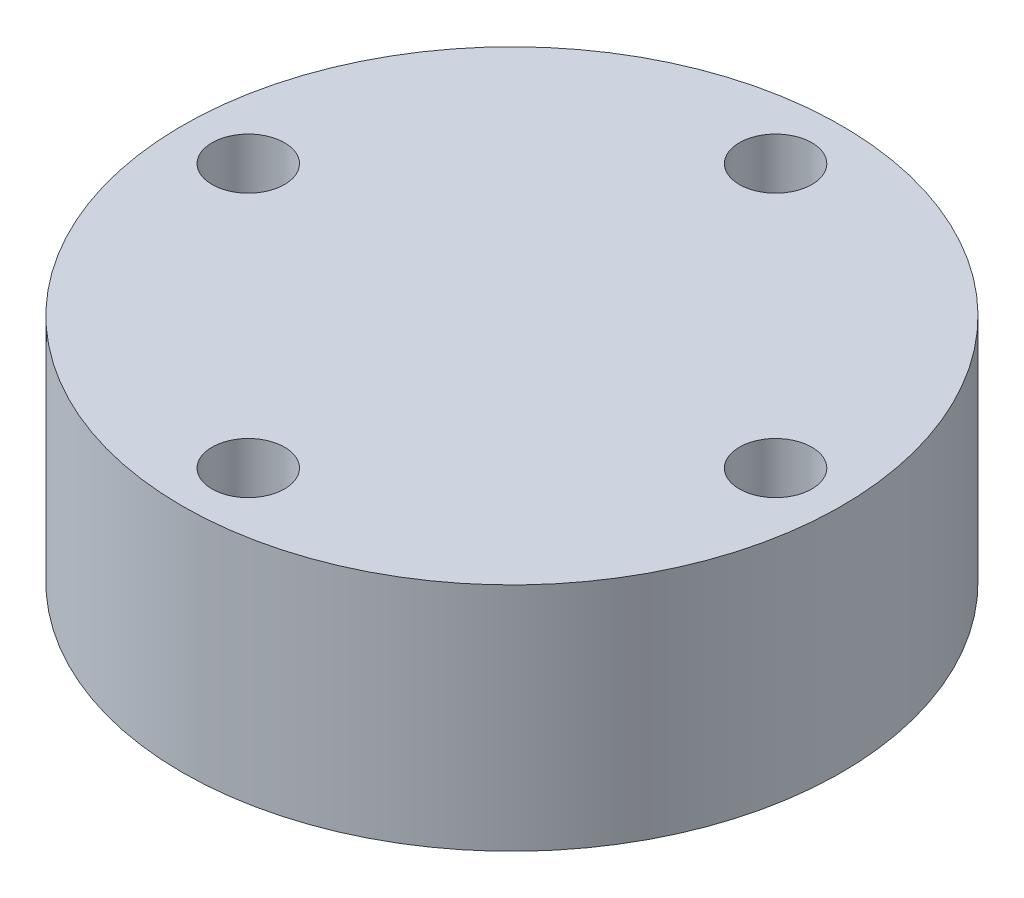
ISO-10303-21;
HEADER;
FILE_DESCRIPTION(('STEP AP214'),'2;1');
FILE_NAME('part.step','',(''),(''),'','','');
FILE_SCHEMA(('AUTOMOTIVE_DESIGN { 1 0 10303 214 1 1 1 1 }'));
ENDSEC;
DATA;
#1=APPLICATION_CONTEXT('core data for automotive mechanical design processes');
#2=APPLICATION_PROTOCOL_DEFINITION('international standard','automotive_design',2000,#1);
#3=PRODUCT_CONTEXT('',#1,'mechanical');
#4=PRODUCT('Part','Part','',(#3));
#5=PRODUCT_RELATED_PRODUCT_CATEGORY('part','',(#4));
#6=PRODUCT_DEFINITION_FORMATION('','',#4);
#7=PRODUCT_DEFINITION_CONTEXT('part definition',#1,'design');
#8=PRODUCT_DEFINITION('design','',#6,#7);
#9=PRODUCT_DEFINITION_SHAPE('','',#8);
#10=(LENGTH_UNIT() NAMED_UNIT(*) SI_UNIT(.MILLI.,.METRE.));
#11=(NAMED_UNIT(*) PLANE_ANGLE_UNIT() SI_UNIT($,.RADIAN.));
#12=(NAMED_UNIT(*) SI_UNIT($,.STERADIAN.) SOLID_ANGLE_UNIT());
#13=UNCERTAINTY_MEASURE_WITH_UNIT(LENGTH_MEASURE(1.E-05),#10,'distance_accuracy_value','');
#14=(GEOMETRIC_REPRESENTATION_CONTEXT(3) GLOBAL_UNCERTAINTY_ASSIGNED_CONTEXT((#13)) GLOBAL_UNIT_ASSIGNED_CONTEXT((#10,
#11,#12)) REPRESENTATION_CONTEXT('',''));
#15=CARTESIAN_POINT('',(0.,0.,0.));
#16=DIRECTION('',(0.,0.,1.));
#17=DIRECTION('',(1.,0.,0.));
#18=AXIS2_PLACEMENT_3D('',#15,#16,#17);
#19=CARTESIAN_POINT('',(0.,7.,0.));
#20=DIRECTION('',(0.,1.,0.));
#21=DIRECTION('',(0.,0.,1.));
#22=AXIS2_PLACEMENT_3D('',#19,#20,#21);
#23=PLANE('',#22);
#24=CARTESIAN_POINT('',(0.,7.,8.));
#25=DIRECTION('',(0.,1.,0.));
#26=DIRECTION('',(0.,0.,1.));
#27=AXIS2_PLACEMENT_3D('',#24,#25,#26);
#28=CIRCLE('',#27,1.10000000000005);
#29=CARTESIAN_POINT('',(0.,7.,9.10000000000005));
#30=VERTEX_POINT('',#29);
#31=EDGE_CURVE('E56',#30,#30,#28,.T.);
#32=ORIENTED_EDGE('',*,*,#31,.F.);
#33=EDGE_LOOP('',(#32));
#34=FACE_BOUND('',#33,.T.);
#35=CARTESIAN_POINT('',(0.,7.,-8.));
#36=DIRECTION('',(0.,1.,0.));
#37=DIRECTION('',(0.,0.,1.));
#38=AXIS2_PLACEMENT_3D('',#35,#36,#37);
#39=CIRCLE('',#38,1.1);
#40=CARTESIAN_POINT('',(0.,7.,-6.9));
#41=VERTEX_POINT('',#40);
#42=EDGE_CURVE('E45',#41,#41,#39,.T.);
#43=ORIENTED_EDGE('',*,*,#42,.F.);
#44=EDGE_LOOP('',(#43));
#45=FACE_BOUND('',#44,.T.);
#46=CARTESIAN_POINT('',(0.,7.,0.));
#47=DIRECTION('',(0.,1.,0.));
#48=DIRECTION('',(0.,0.,1.));
#49=AXIS2_PLACEMENT_3D('',#46,#47,#48);
#50=CIRCLE('',#49,10.);
#51=CARTESIAN_POINT('',(0.,7.,10.));
#52=VERTEX_POINT('',#51);
#53=EDGE_CURVE('E10',#52,#52,#50,.T.);
#54=ORIENTED_EDGE('',*,*,#53,.T.);
#55=EDGE_LOOP('',(#54));
#56=FACE_BOUND('',#55,.T.);
#57=CARTESIAN_POINT('',(8.,7.,0.));
#58=DIRECTION('',(0.,1.,0.));
#59=DIRECTION('',(0.,0.,1.));
#60=AXIS2_PLACEMENT_3D('',#57,#58,#59);
#61=CIRCLE('',#60,1.10000000000003);
#62=CARTESIAN_POINT('',(8.,7.,1.10000000000003));
#63=VERTEX_POINT('',#62);
#64=EDGE_CURVE('E50',#63,#63,#61,.T.);
#65=ORIENTED_EDGE('',*,*,#64,.F.);
#66=EDGE_LOOP('',(#65));
#67=FACE_BOUND('',#66,.T.);
#68=CARTESIAN_POINT('',(-8.,7.,0.));
#69=DIRECTION('',(0.,1.,0.));
#70=DIRECTION('',(0.,0.,1.));
#71=AXIS2_PLACEMENT_3D('',#68,#69,#70);
#72=CIRCLE('',#71,1.10000000000008);
#73=CARTESIAN_POINT('',(-8.,7.,1.10000000000008));
#74=VERTEX_POINT('',#73);
#75=EDGE_CURVE('E62',#74,#74,#72,.T.);
#76=ORIENTED_EDGE('',*,*,#75,.F.);
#77=EDGE_LOOP('',(#76));
#78=FACE_BOUND('',#77,.T.);
#79=ADVANCED_FACE('F34',(#34,#45,#56,#67,#78),#23,.T.);
#80=CARTESIAN_POINT('',(0.,0.,0.));
#81=DIRECTION('',(0.,1.,0.));
#82=DIRECTION('',(0.,0.,1.));
#83=AXIS2_PLACEMENT_3D('',#80,#81,#82);
#84=PLANE('',#83);
#85=CARTESIAN_POINT('',(0.,0.,0.));
#86=DIRECTION('',(0.,1.,0.));
#87=DIRECTION('',(0.,0.,1.));
#88=AXIS2_PLACEMENT_3D('',#85,#86,#87);
#89=CIRCLE('',#88,10.);
#90=CARTESIAN_POINT('',(0.,0.,10.));
#91=VERTEX_POINT('',#90);
#92=EDGE_CURVE('E38',#91,#91,#89,.T.);
#93=ORIENTED_EDGE('',*,*,#92,.F.);
#94=EDGE_LOOP('',(#93));
#95=FACE_BOUND('',#94,.T.);
#96=CARTESIAN_POINT('',(0.,0.,-8.));
#97=DIRECTION('',(0.,1.,0.));
#98=DIRECTION('',(0.,0.,1.));
#99=AXIS2_PLACEMENT_3D('',#96,#97,#98);
#100=CIRCLE('',#99,1.1);
#101=CARTESIAN_POINT('',(0.,0.,-6.9));
#102=VERTEX_POINT('',#101);
#103=EDGE_CURVE('E47',#102,#102,#100,.T.);
#104=ORIENTED_EDGE('',*,*,#103,.T.);
#105=EDGE_LOOP('',(#104));
#106=FACE_BOUND('',#105,.T.);
#107=CARTESIAN_POINT('',(8.,0.,0.));
#108=DIRECTION('',(0.,1.,0.));
#109=DIRECTION('',(0.,0.,1.));
#110=AXIS2_PLACEMENT_3D('',#107,#108,#109);
#111=CIRCLE('',#110,1.10000000000003);
#112=CARTESIAN_POINT('',(8.,0.,1.10000000000003));
#113=VERTEX_POINT('',#112);
#114=EDGE_CURVE('E53',#113,#113,#111,.T.);
#115=ORIENTED_EDGE('',*,*,#114,.T.);
#116=EDGE_LOOP('',(#115));
#117=FACE_BOUND('',#116,.T.);
#118=CARTESIAN_POINT('',(0.,0.,8.));
#119=DIRECTION('',(0.,1.,0.));
#120=DIRECTION('',(0.,0.,1.));
#121=AXIS2_PLACEMENT_3D('',#118,#119,#120);
#122=CIRCLE('',#121,1.10000000000005);
#123=CARTESIAN_POINT('',(0.,0.,9.10000000000005));
#124=VERTEX_POINT('',#123);
#125=EDGE_CURVE('E59',#124,#124,#122,.T.);
#126=ORIENTED_EDGE('',*,*,#125,.T.);
#127=EDGE_LOOP('',(#126));
#128=FACE_BOUND('',#127,.T.);
#129=CARTESIAN_POINT('',(-8.,0.,0.));
#130=DIRECTION('',(0.,1.,0.));
#131=DIRECTION('',(0.,0.,1.));
#132=AXIS2_PLACEMENT_3D('',#129,#130,#131);
#133=CIRCLE('',#132,1.10000000000008);
#134=CARTESIAN_POINT('',(-8.,0.,1.10000000000008));
#135=VERTEX_POINT('',#134);
#136=EDGE_CURVE('E65',#135,#135,#133,.T.);
#137=ORIENTED_EDGE('',*,*,#136,.T.);
#138=EDGE_LOOP('',(#137));
#139=FACE_BOUND('',#138,.T.);
#140=ADVANCED_FACE('F75',(#95,#106,#117,#128,#139),#84,.F.);
#141=CARTESIAN_POINT('',(0.,7.,0.));
#142=DIRECTION('',(0.,-1.,0.));
#143=DIRECTION('',(0.,0.,-1.));
#144=AXIS2_PLACEMENT_3D('',#141,#142,#143);
#145=CYLINDRICAL_SURFACE('',#144,10.);
#146=ORIENTED_EDGE('',*,*,#53,.F.);
#147=EDGE_LOOP('',(#146));
#148=FACE_BOUND('',#147,.T.);
#149=ORIENTED_EDGE('',*,*,#92,.T.);
#150=EDGE_LOOP('',(#149));
#151=FACE_BOUND('',#150,.T.);
#152=ADVANCED_FACE('F36',(#148,#151),#145,.T.);
#153=CARTESIAN_POINT('',(0.,7.,-8.));
#154=DIRECTION('',(0.,-1.,0.));
#155=DIRECTION('',(0.,0.,-1.));
#156=AXIS2_PLACEMENT_3D('',#153,#154,#155);
#157=CYLINDRICAL_SURFACE('',#156,1.1);
#158=ORIENTED_EDGE('',*,*,#42,.T.);
#159=EDGE_LOOP('',(#158));
#160=FACE_BOUND('',#159,.T.);
#161=ORIENTED_EDGE('',*,*,#103,.F.);
#162=EDGE_LOOP('',(#161));
#163=FACE_BOUND('',#162,.T.);
#164=ADVANCED_FACE('F85',(#160,#163),#157,.F.);
#165=CARTESIAN_POINT('',(8.,7.,0.));
#166=DIRECTION('',(0.,-1.,0.));
#167=DIRECTION('',(0.,0.,-1.));
#168=AXIS2_PLACEMENT_3D('',#165,#166,#167);
#169=CYLINDRICAL_SURFACE('',#168,1.10000000000003);
#170=ORIENTED_EDGE('',*,*,#64,.T.);
#171=EDGE_LOOP('',(#170));
#172=FACE_BOUND('',#171,.T.);
#173=ORIENTED_EDGE('',*,*,#114,.F.);
#174=EDGE_LOOP('',(#173));
#175=FACE_BOUND('',#174,.T.);
#176=ADVANCED_FACE('F88',(#172,#175),#169,.F.);
#177=CARTESIAN_POINT('',(0.,7.,8.));
#178=DIRECTION('',(0.,-1.,0.));
#179=DIRECTION('',(0.,0.,-1.));
#180=AXIS2_PLACEMENT_3D('',#177,#178,#179);
#181=CYLINDRICAL_SURFACE('',#180,1.10000000000005);
#182=ORIENTED_EDGE('',*,*,#31,.T.);
#183=EDGE_LOOP('',(#182));
#184=FACE_BOUND('',#183,.T.);
#185=ORIENTED_EDGE('',*,*,#125,.F.);
#186=EDGE_LOOP('',(#185));
#187=FACE_BOUND('',#186,.T.);
#188=ADVANCED_FACE('F92',(#184,#187),#181,.F.);
#189=CARTESIAN_POINT('',(-8.,7.,0.));
#190=DIRECTION('',(0.,-1.,0.));
#191=DIRECTION('',(0.,0.,-1.));
#192=AXIS2_PLACEMENT_3D('',#189,#190,#191);
#193=CYLINDRICAL_SURFACE('',#192,1.10000000000008);
#194=ORIENTED_EDGE('',*,*,#75,.T.);
#195=EDGE_LOOP('',(#194));
#196=FACE_BOUND('',#195,.T.);
#197=ORIENTED_EDGE('',*,*,#136,.F.);
#198=EDGE_LOOP('',(#197));
#199=FACE_BOUND('',#198,.T.);
#200=ADVANCED_FACE('F71',(#196,#199),#193,.F.);
#201=CLOSED_SHELL('',(#79,#140,#152,#164,#176,#188,#200));
#202=MANIFOLD_SOLID_BREP('B2',#201);
#203=ADVANCED_BREP_SHAPE_REPRESENTATION('',(#18,#202),#14);
#204=SHAPE_DEFINITION_REPRESENTATION(#9,#203);
ENDSEC;
END-ISO-10303-21;
